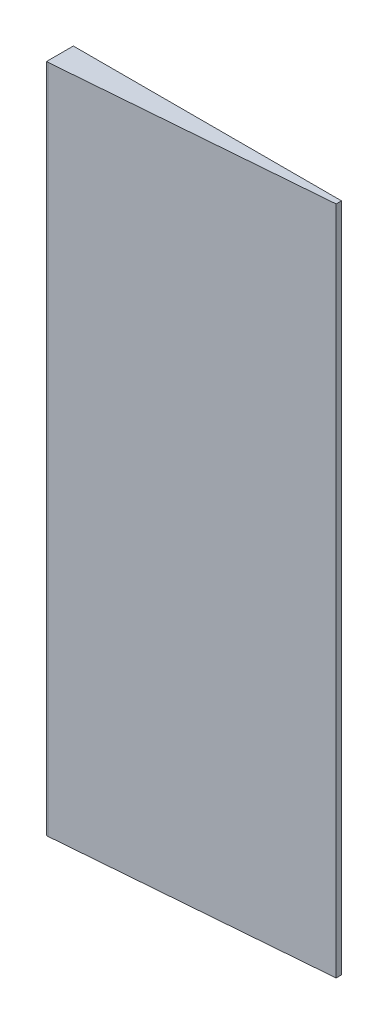
ISO-10303-21;
HEADER;
FILE_DESCRIPTION(('STEP AP214'),'2;1');
FILE_NAME('part.step','',(''),(''),'','','');
FILE_SCHEMA(('AUTOMOTIVE_DESIGN { 1 0 10303 214 1 1 1 1 }'));
ENDSEC;
DATA;
#1=APPLICATION_CONTEXT('core data for automotive mechanical design processes');
#2=APPLICATION_PROTOCOL_DEFINITION('international standard','automotive_design',2000,#1);
#3=PRODUCT_CONTEXT('',#1,'mechanical');
#4=PRODUCT('Part','Part','',(#3));
#5=PRODUCT_RELATED_PRODUCT_CATEGORY('part','',(#4));
#6=PRODUCT_DEFINITION_FORMATION('','',#4);
#7=PRODUCT_DEFINITION_CONTEXT('part definition',#1,'design');
#8=PRODUCT_DEFINITION('design','',#6,#7);
#9=PRODUCT_DEFINITION_SHAPE('','',#8);
#10=(LENGTH_UNIT() NAMED_UNIT(*) SI_UNIT(.MILLI.,.METRE.));
#11=(NAMED_UNIT(*) PLANE_ANGLE_UNIT() SI_UNIT($,.RADIAN.));
#12=(NAMED_UNIT(*) SI_UNIT($,.STERADIAN.) SOLID_ANGLE_UNIT());
#13=UNCERTAINTY_MEASURE_WITH_UNIT(LENGTH_MEASURE(1.E-05),#10,'distance_accuracy_value','');
#14=(GEOMETRIC_REPRESENTATION_CONTEXT(3) GLOBAL_UNCERTAINTY_ASSIGNED_CONTEXT((#13)) GLOBAL_UNIT_ASSIGNED_CONTEXT((#10,
#11,#12)) REPRESENTATION_CONTEXT('',''));
#15=CARTESIAN_POINT('',(0.,0.,0.));
#16=DIRECTION('',(0.,0.,1.));
#17=DIRECTION('',(1.,0.,0.));
#18=AXIS2_PLACEMENT_3D('',#15,#16,#17);
#19=CARTESIAN_POINT('',(0.,0.,1.));
#20=DIRECTION('',(0.,-1.,0.));
#21=DIRECTION('',(1.,0.,0.));
#22=AXIS2_PLACEMENT_3D('',#19,#20,#21);
#23=PLANE('',#22);
#24=DIRECTION('',(0.,0.,-1.));
#25=VECTOR('',#24,1.);
#26=CARTESIAN_POINT('',(0.,0.,1.));
#27=LINE('',#26,#25);
#28=CARTESIAN_POINT('',(0.,0.,0.2));
#29=VERTEX_POINT('',#28);
#30=CARTESIAN_POINT('',(0.,0.,0.));
#31=VERTEX_POINT('',#30);
#32=EDGE_CURVE('E121',#29,#31,#27,.T.);
#33=ORIENTED_EDGE('',*,*,#32,.F.);
#34=DIRECTION('',(0.996778878456247,0.,-0.0801989243288591));
#35=VECTOR('',#34,1.);
#36=CARTESIAN_POINT('',(-0.0639524750767341,0.,0.205145493970805));
#37=LINE('',#36,#35);
#38=CARTESIAN_POINT('',(-9.94306481587123,0.,1.));
#39=VERTEX_POINT('',#38);
#40=EDGE_CURVE('E11',#29,#39,#37,.F.);
#41=ORIENTED_EDGE('',*,*,#40,.T.);
#42=DIRECTION('',(-1.,0.,0.));
#43=VECTOR('',#42,1.);
#44=CARTESIAN_POINT('',(0.,0.,1.));
#45=LINE('',#44,#43);
#46=CARTESIAN_POINT('',(-10.,0.,1.));
#47=VERTEX_POINT('',#46);
#48=EDGE_CURVE('E86',#39,#47,#45,.T.);
#49=ORIENTED_EDGE('',*,*,#48,.T.);
#50=DIRECTION('',(0.,0.,-1.));
#51=VECTOR('',#50,1.);
#52=CARTESIAN_POINT('',(-10.,0.,1.));
#53=LINE('',#52,#51);
#54=CARTESIAN_POINT('',(-10.,0.,0.));
#55=VERTEX_POINT('',#54);
#56=EDGE_CURVE('E89',#47,#55,#53,.T.);
#57=ORIENTED_EDGE('',*,*,#56,.T.);
#58=DIRECTION('',(-1.,0.,0.));
#59=VECTOR('',#58,1.);
#60=CARTESIAN_POINT('',(0.,0.,0.));
#61=LINE('',#60,#59);
#62=EDGE_CURVE('E113',#31,#55,#61,.T.);
#63=ORIENTED_EDGE('',*,*,#62,.F.);
#64=EDGE_LOOP('',(#33,#41,#49,#57,#63));
#65=FACE_BOUND('',#64,.T.);
#66=ADVANCED_FACE('F41',(#65),#23,.T.);
#67=CARTESIAN_POINT('',(0.,0.,1.));
#68=DIRECTION('',(-1.,0.,0.));
#69=DIRECTION('',(0.,0.,1.));
#70=AXIS2_PLACEMENT_3D('',#67,#68,#69);
#71=PLANE('',#70);
#72=DIRECTION('',(0.,0.,-1.));
#73=VECTOR('',#72,1.);
#74=CARTESIAN_POINT('',(0.,25.,1.));
#75=LINE('',#74,#73);
#76=CARTESIAN_POINT('',(0.,25.,0.2));
#77=VERTEX_POINT('',#76);
#78=CARTESIAN_POINT('',(0.,25.,0.));
#79=VERTEX_POINT('',#78);
#80=EDGE_CURVE('E124',#77,#79,#75,.T.);
#81=ORIENTED_EDGE('',*,*,#80,.F.);
#82=DIRECTION('',(0.,-1.,0.));
#83=VECTOR('',#82,1.);
#84=CARTESIAN_POINT('',(0.,0.,0.2));
#85=LINE('',#84,#83);
#86=EDGE_CURVE('E50',#77,#29,#85,.T.);
#87=ORIENTED_EDGE('',*,*,#86,.T.);
#88=ORIENTED_EDGE('',*,*,#32,.T.);
#89=DIRECTION('',(0.,1.,0.));
#90=VECTOR('',#89,1.);
#91=CARTESIAN_POINT('',(0.,0.,0.));
#92=LINE('',#91,#90);
#93=EDGE_CURVE('E97',#31,#79,#92,.T.);
#94=ORIENTED_EDGE('',*,*,#93,.T.);
#95=EDGE_LOOP('',(#81,#87,#88,#94));
#96=FACE_BOUND('',#95,.T.);
#97=ADVANCED_FACE('F141',(#96),#71,.F.);
#98=CARTESIAN_POINT('',(0.,25.,1.));
#99=DIRECTION('',(0.,-1.,0.));
#100=DIRECTION('',(0.,0.,-1.));
#101=AXIS2_PLACEMENT_3D('',#98,#99,#100);
#102=PLANE('',#101);
#103=DIRECTION('',(-1.,0.,0.));
#104=VECTOR('',#103,1.);
#105=CARTESIAN_POINT('',(0.,25.,1.));
#106=LINE('',#105,#104);
#107=CARTESIAN_POINT('',(-9.94306481587123,25.,1.));
#108=VERTEX_POINT('',#107);
#109=CARTESIAN_POINT('',(-10.,25.,1.));
#110=VERTEX_POINT('',#109);
#111=EDGE_CURVE('E106',#108,#110,#106,.T.);
#112=ORIENTED_EDGE('',*,*,#111,.F.);
#113=DIRECTION('',(-0.996778878456247,0.,0.0801989243288591));
#114=VECTOR('',#113,1.);
#115=CARTESIAN_POINT('',(-9.94306481587123,25.,1.));
#116=LINE('',#115,#114);
#117=EDGE_CURVE('E64',#108,#77,#116,.F.);
#118=ORIENTED_EDGE('',*,*,#117,.T.);
#119=ORIENTED_EDGE('',*,*,#80,.T.);
#120=DIRECTION('',(-1.,0.,0.));
#121=VECTOR('',#120,1.);
#122=CARTESIAN_POINT('',(0.,25.,0.));
#123=LINE('',#122,#121);
#124=CARTESIAN_POINT('',(-10.,25.,0.));
#125=VERTEX_POINT('',#124);
#126=EDGE_CURVE('E116',#79,#125,#123,.T.);
#127=ORIENTED_EDGE('',*,*,#126,.T.);
#128=DIRECTION('',(0.,0.,-1.));
#129=VECTOR('',#128,1.);
#130=CARTESIAN_POINT('',(-10.,25.,1.));
#131=LINE('',#130,#129);
#132=EDGE_CURVE('E105',#110,#125,#131,.T.);
#133=ORIENTED_EDGE('',*,*,#132,.F.);
#134=EDGE_LOOP('',(#112,#118,#119,#127,#133));
#135=FACE_BOUND('',#134,.T.);
#136=ADVANCED_FACE('F129',(#135),#102,.F.);
#137=CARTESIAN_POINT('',(-10.,0.,1.));
#138=DIRECTION('',(-1.,0.,0.));
#139=DIRECTION('',(0.,0.,1.));
#140=AXIS2_PLACEMENT_3D('',#137,#138,#139);
#141=PLANE('',#140);
#142=DIRECTION('',(0.,1.,0.));
#143=VECTOR('',#142,1.);
#144=CARTESIAN_POINT('',(-10.,0.,0.));
#145=LINE('',#144,#143);
#146=EDGE_CURVE('E103',#55,#125,#145,.T.);
#147=ORIENTED_EDGE('',*,*,#146,.F.);
#148=ORIENTED_EDGE('',*,*,#56,.F.);
#149=DIRECTION('',(0.,1.,0.));
#150=VECTOR('',#149,1.);
#151=CARTESIAN_POINT('',(-10.,0.,1.));
#152=LINE('',#151,#150);
#153=EDGE_CURVE('E96',#47,#110,#152,.T.);
#154=ORIENTED_EDGE('',*,*,#153,.T.);
#155=ORIENTED_EDGE('',*,*,#132,.T.);
#156=EDGE_LOOP('',(#147,#148,#154,#155));
#157=FACE_BOUND('',#156,.T.);
#158=ADVANCED_FACE('F101',(#157),#141,.T.);
#159=CARTESIAN_POINT('',(0.,0.,1.));
#160=DIRECTION('',(0.,0.,-1.));
#161=DIRECTION('',(-1.,0.,0.));
#162=AXIS2_PLACEMENT_3D('',#159,#160,#161);
#163=PLANE('',#162);
#164=ORIENTED_EDGE('',*,*,#48,.F.);
#165=DIRECTION('',(0.,1.,0.));
#166=VECTOR('',#165,1.);
#167=CARTESIAN_POINT('',(-9.94306481587123,0.,1.));
#168=LINE('',#167,#166);
#169=EDGE_CURVE('E123',#39,#108,#168,.T.);
#170=ORIENTED_EDGE('',*,*,#169,.T.);
#171=ORIENTED_EDGE('',*,*,#111,.T.);
#172=ORIENTED_EDGE('',*,*,#153,.F.);
#173=EDGE_LOOP('',(#164,#170,#171,#172));
#174=FACE_BOUND('',#173,.T.);
#175=ADVANCED_FACE('F108',(#174),#163,.F.);
#176=CARTESIAN_POINT('',(0.,0.,0.));
#177=DIRECTION('',(0.,0.,-1.));
#178=DIRECTION('',(-1.,0.,0.));
#179=AXIS2_PLACEMENT_3D('',#176,#177,#178);
#180=PLANE('',#179);
#181=ORIENTED_EDGE('',*,*,#62,.T.);
#182=ORIENTED_EDGE('',*,*,#146,.T.);
#183=ORIENTED_EDGE('',*,*,#126,.F.);
#184=ORIENTED_EDGE('',*,*,#93,.F.);
#185=EDGE_LOOP('',(#181,#182,#183,#184));
#186=FACE_BOUND('',#185,.T.);
#187=ADVANCED_FACE('F133',(#186),#180,.T.);
#188=CARTESIAN_POINT('',(-9.94306481587123,0.,1.));
#189=DIRECTION('',(-0.0801989243288591,0.,-0.996778878456247));
#190=DIRECTION('',(0.,1.,0.));
#191=AXIS2_PLACEMENT_3D('',#188,#189,#190);
#192=PLANE('',#191);
#193=ORIENTED_EDGE('',*,*,#40,.F.);
#194=ORIENTED_EDGE('',*,*,#86,.F.);
#195=ORIENTED_EDGE('',*,*,#117,.F.);
#196=ORIENTED_EDGE('',*,*,#169,.F.);
#197=EDGE_LOOP('',(#193,#194,#195,#196));
#198=FACE_BOUND('',#197,.T.);
#199=ADVANCED_FACE('F44',(#198),#192,.F.);
#200=CLOSED_SHELL('',(#66,#97,#136,#158,#175,#187,#199));
#201=MANIFOLD_SOLID_BREP('B2',#200);
#202=ADVANCED_BREP_SHAPE_REPRESENTATION('',(#18,#201),#14);
#203=SHAPE_DEFINITION_REPRESENTATION(#9,#202);
ENDSEC;
END-ISO-10303-21;
